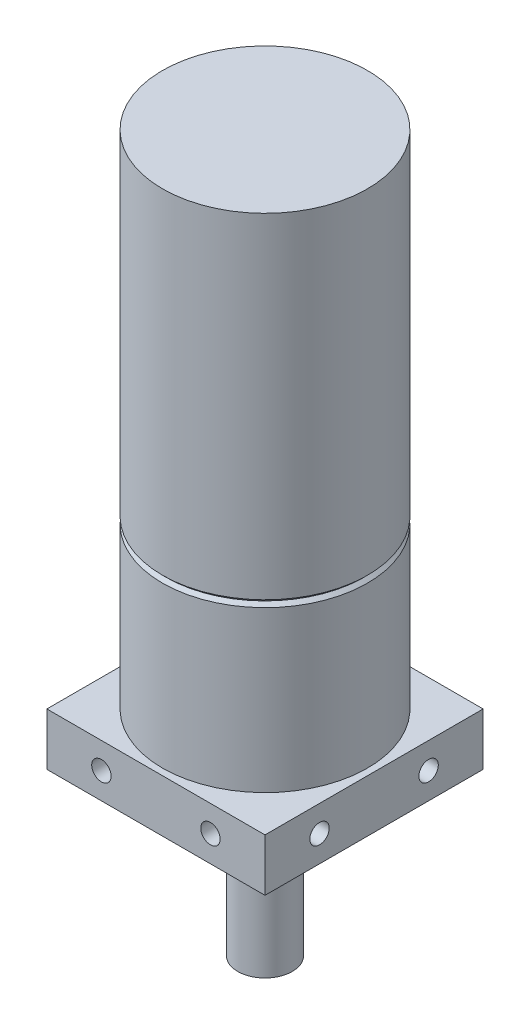
ISO-10303-21;
HEADER;
FILE_DESCRIPTION(('STEP AP214'),'2;1');
FILE_NAME('part.step','',(''),(''),'','','');
FILE_SCHEMA(('AUTOMOTIVE_DESIGN { 1 0 10303 214 1 1 1 1 }'));
ENDSEC;
DATA;
#1=APPLICATION_CONTEXT('core data for automotive mechanical design processes');
#2=APPLICATION_PROTOCOL_DEFINITION('international standard','automotive_design',2000,#1);
#3=PRODUCT_CONTEXT('',#1,'mechanical');
#4=PRODUCT('Part','Part','',(#3));
#5=PRODUCT_RELATED_PRODUCT_CATEGORY('part','',(#4));
#6=PRODUCT_DEFINITION_FORMATION('','',#4);
#7=PRODUCT_DEFINITION_CONTEXT('part definition',#1,'design');
#8=PRODUCT_DEFINITION('design','',#6,#7);
#9=PRODUCT_DEFINITION_SHAPE('','',#8);
#10=(LENGTH_UNIT() NAMED_UNIT(*) SI_UNIT(.MILLI.,.METRE.));
#11=(NAMED_UNIT(*) PLANE_ANGLE_UNIT() SI_UNIT($,.RADIAN.));
#12=(NAMED_UNIT(*) SI_UNIT($,.STERADIAN.) SOLID_ANGLE_UNIT());
#13=UNCERTAINTY_MEASURE_WITH_UNIT(LENGTH_MEASURE(1.E-05),#10,'distance_accuracy_value','');
#14=(GEOMETRIC_REPRESENTATION_CONTEXT(3) GLOBAL_UNCERTAINTY_ASSIGNED_CONTEXT((#13)) GLOBAL_UNIT_ASSIGNED_CONTEXT((#10,
#11,#12)) REPRESENTATION_CONTEXT('',''));
#15=CARTESIAN_POINT('',(0.,0.,0.));
#16=DIRECTION('',(0.,0.,1.));
#17=DIRECTION('',(1.,0.,0.));
#18=AXIS2_PLACEMENT_3D('',#15,#16,#17);
#19=CARTESIAN_POINT('',(-12.7,0.,12.7));
#20=DIRECTION('',(0.,1.,0.));
#21=DIRECTION('',(0.,0.,1.));
#22=AXIS2_PLACEMENT_3D('',#19,#20,#21);
#23=PLANE('',#22);
#24=CARTESIAN_POINT('',(6.35,0.,-6.35));
#25=DIRECTION('',(0.,-1.,0.));
#26=DIRECTION('',(0.,0.,-1.));
#27=AXIS2_PLACEMENT_3D('',#24,#25,#26);
#28=CIRCLE('',#27,1.13029999999999);
#29=CARTESIAN_POINT('',(6.35,0.,-7.48029999999999));
#30=VERTEX_POINT('',#29);
#31=EDGE_CURVE('E186',#30,#30,#28,.T.);
#32=ORIENTED_EDGE('',*,*,#31,.F.);
#33=EDGE_LOOP('',(#32));
#34=FACE_BOUND('',#33,.T.);
#35=CARTESIAN_POINT('',(6.35,0.,6.35));
#36=DIRECTION('',(0.,-1.,0.));
#37=DIRECTION('',(0.,0.,-1.));
#38=AXIS2_PLACEMENT_3D('',#35,#36,#37);
#39=CIRCLE('',#38,1.13029999999999);
#40=CARTESIAN_POINT('',(6.35,0.,5.21970000000001));
#41=VERTEX_POINT('',#40);
#42=EDGE_CURVE('E192',#41,#41,#39,.T.);
#43=ORIENTED_EDGE('',*,*,#42,.F.);
#44=EDGE_LOOP('',(#43));
#45=FACE_BOUND('',#44,.T.);
#46=CARTESIAN_POINT('',(-6.35,0.,6.35));
#47=DIRECTION('',(0.,-1.,0.));
#48=DIRECTION('',(0.,0.,-1.));
#49=AXIS2_PLACEMENT_3D('',#46,#47,#48);
#50=CIRCLE('',#49,1.13029999999999);
#51=CARTESIAN_POINT('',(-6.35,0.,5.21970000000001));
#52=VERTEX_POINT('',#51);
#53=EDGE_CURVE('E198',#52,#52,#50,.T.);
#54=ORIENTED_EDGE('',*,*,#53,.F.);
#55=EDGE_LOOP('',(#54));
#56=FACE_BOUND('',#55,.T.);
#57=CARTESIAN_POINT('',(-6.35,0.,-6.35));
#58=DIRECTION('',(0.,-1.,0.));
#59=DIRECTION('',(0.,0.,-1.));
#60=AXIS2_PLACEMENT_3D('',#57,#58,#59);
#61=CIRCLE('',#60,1.13029999999999);
#62=CARTESIAN_POINT('',(-6.35,0.,-7.48029999999999));
#63=VERTEX_POINT('',#62);
#64=EDGE_CURVE('E204',#63,#63,#61,.T.);
#65=ORIENTED_EDGE('',*,*,#64,.F.);
#66=EDGE_LOOP('',(#65));
#67=FACE_BOUND('',#66,.T.);
#68=DIRECTION('',(0.,0.,1.));
#69=VECTOR('',#68,1.);
#70=CARTESIAN_POINT('',(-12.7,0.,-12.7));
#71=LINE('',#70,#69);
#72=CARTESIAN_POINT('',(-12.7,0.,-12.7));
#73=VERTEX_POINT('',#72);
#74=CARTESIAN_POINT('',(-12.7,0.,12.7));
#75=VERTEX_POINT('',#74);
#76=EDGE_CURVE('E217',#73,#75,#71,.T.);
#77=ORIENTED_EDGE('',*,*,#76,.F.);
#78=DIRECTION('',(-1.,0.,0.));
#79=VECTOR('',#78,1.);
#80=CARTESIAN_POINT('',(-12.7,0.,-12.7));
#81=LINE('',#80,#79);
#82=CARTESIAN_POINT('',(12.7,0.,-12.7));
#83=VERTEX_POINT('',#82);
#84=EDGE_CURVE('E79',#83,#73,#81,.T.);
#85=ORIENTED_EDGE('',*,*,#84,.F.);
#86=DIRECTION('',(0.,0.,-1.));
#87=VECTOR('',#86,1.);
#88=CARTESIAN_POINT('',(12.7,0.,-12.7));
#89=LINE('',#88,#87);
#90=CARTESIAN_POINT('',(12.7,0.,12.7));
#91=VERTEX_POINT('',#90);
#92=EDGE_CURVE('E73',#91,#83,#89,.T.);
#93=ORIENTED_EDGE('',*,*,#92,.F.);
#94=DIRECTION('',(1.,0.,0.));
#95=VECTOR('',#94,1.);
#96=CARTESIAN_POINT('',(-12.7,0.,12.7));
#97=LINE('',#96,#95);
#98=EDGE_CURVE('E229',#75,#91,#97,.T.);
#99=ORIENTED_EDGE('',*,*,#98,.F.);
#100=EDGE_LOOP('',(#77,#85,#93,#99));
#101=FACE_BOUND('',#100,.T.);
#102=CARTESIAN_POINT('',(0.,0.,0.));
#103=DIRECTION('',(0.,1.,0.));
#104=DIRECTION('',(0.,0.,1.));
#105=AXIS2_PLACEMENT_3D('',#102,#103,#104);
#106=CIRCLE('',#105,3.175);
#107=CARTESIAN_POINT('',(0.,0.,3.175));
#108=VERTEX_POINT('',#107);
#109=EDGE_CURVE('E11',#108,#108,#106,.F.);
#110=ORIENTED_EDGE('',*,*,#109,.F.);
#111=EDGE_LOOP('',(#110));
#112=FACE_BOUND('',#111,.T.);
#113=ADVANCED_FACE('F38',(#34,#45,#56,#67,#101,#112),#23,.F.);
#114=CARTESIAN_POINT('',(-12.7,6.096,12.7));
#115=DIRECTION('',(0.,1.,0.));
#116=DIRECTION('',(0.,0.,1.));
#117=AXIS2_PLACEMENT_3D('',#114,#115,#116);
#118=PLANE('',#117);
#119=DIRECTION('',(0.,0.,1.));
#120=VECTOR('',#119,1.);
#121=CARTESIAN_POINT('',(-12.7,6.096,-12.7));
#122=LINE('',#121,#120);
#123=CARTESIAN_POINT('',(-12.7,6.096,-12.7));
#124=VERTEX_POINT('',#123);
#125=CARTESIAN_POINT('',(-12.7,6.096,12.7));
#126=VERTEX_POINT('',#125);
#127=EDGE_CURVE('E220',#124,#126,#122,.T.);
#128=ORIENTED_EDGE('',*,*,#127,.T.);
#129=DIRECTION('',(1.,0.,0.));
#130=VECTOR('',#129,1.);
#131=CARTESIAN_POINT('',(-12.7,6.096,12.7));
#132=LINE('',#131,#130);
#133=CARTESIAN_POINT('',(12.7,6.096,12.7));
#134=VERTEX_POINT('',#133);
#135=EDGE_CURVE('E87',#126,#134,#132,.T.);
#136=ORIENTED_EDGE('',*,*,#135,.T.);
#137=DIRECTION('',(0.,0.,-1.));
#138=VECTOR('',#137,1.);
#139=CARTESIAN_POINT('',(12.7,6.096,-12.7));
#140=LINE('',#139,#138);
#141=CARTESIAN_POINT('',(12.7,6.096,-12.7));
#142=VERTEX_POINT('',#141);
#143=EDGE_CURVE('E223',#134,#142,#140,.T.);
#144=ORIENTED_EDGE('',*,*,#143,.T.);
#145=DIRECTION('',(-1.,0.,0.));
#146=VECTOR('',#145,1.);
#147=CARTESIAN_POINT('',(-12.7,6.096,-12.7));
#148=LINE('',#147,#146);
#149=EDGE_CURVE('E55',#142,#124,#148,.T.);
#150=ORIENTED_EDGE('',*,*,#149,.T.);
#151=EDGE_LOOP('',(#128,#136,#144,#150));
#152=FACE_BOUND('',#151,.T.);
#153=CARTESIAN_POINT('',(0.,6.096,0.));
#154=DIRECTION('',(0.,1.,0.));
#155=DIRECTION('',(0.,0.,1.));
#156=AXIS2_PLACEMENT_3D('',#153,#154,#155);
#157=CIRCLE('',#156,11.938);
#158=CARTESIAN_POINT('',(0.,6.096,11.938));
#159=VERTEX_POINT('',#158);
#160=EDGE_CURVE('E213',#159,#159,#157,.T.);
#161=ORIENTED_EDGE('',*,*,#160,.F.);
#162=EDGE_LOOP('',(#161));
#163=FACE_BOUND('',#162,.T.);
#164=ADVANCED_FACE('F245',(#152,#163),#118,.T.);
#165=CARTESIAN_POINT('',(-12.7,6.096,-12.7));
#166=DIRECTION('',(1.,0.,0.));
#167=DIRECTION('',(0.,0.,-1.));
#168=AXIS2_PLACEMENT_3D('',#165,#166,#167);
#169=PLANE('',#168);
#170=CARTESIAN_POINT('',(-12.7,3.048,-6.35));
#171=DIRECTION('',(-1.,0.,0.));
#172=DIRECTION('',(0.,0.,1.));
#173=AXIS2_PLACEMENT_3D('',#170,#171,#172);
#174=CIRCLE('',#173,1.13029999999999);
#175=CARTESIAN_POINT('',(-12.7,3.048,-5.21970000000001));
#176=VERTEX_POINT('',#175);
#177=EDGE_CURVE('E177',#176,#176,#174,.T.);
#178=ORIENTED_EDGE('',*,*,#177,.F.);
#179=EDGE_LOOP('',(#178));
#180=FACE_BOUND('',#179,.T.);
#181=CARTESIAN_POINT('',(-12.7,3.048,6.35));
#182=DIRECTION('',(-1.,0.,0.));
#183=DIRECTION('',(0.,0.,1.));
#184=AXIS2_PLACEMENT_3D('',#181,#182,#183);
#185=CIRCLE('',#184,1.13029999999999);
#186=CARTESIAN_POINT('',(-12.7,3.048,7.48029999999999));
#187=VERTEX_POINT('',#186);
#188=EDGE_CURVE('E183',#187,#187,#185,.T.);
#189=ORIENTED_EDGE('',*,*,#188,.F.);
#190=EDGE_LOOP('',(#189));
#191=FACE_BOUND('',#190,.T.);
#192=ORIENTED_EDGE('',*,*,#76,.T.);
#193=DIRECTION('',(0.,-1.,0.));
#194=VECTOR('',#193,1.);
#195=CARTESIAN_POINT('',(-12.7,6.096,12.7));
#196=LINE('',#195,#194);
#197=EDGE_CURVE('E47',#126,#75,#196,.T.);
#198=ORIENTED_EDGE('',*,*,#197,.F.);
#199=ORIENTED_EDGE('',*,*,#127,.F.);
#200=DIRECTION('',(0.,-1.,0.));
#201=VECTOR('',#200,1.);
#202=CARTESIAN_POINT('',(-12.7,6.096,-12.7));
#203=LINE('',#202,#201);
#204=EDGE_CURVE('E226',#124,#73,#203,.T.);
#205=ORIENTED_EDGE('',*,*,#204,.T.);
#206=EDGE_LOOP('',(#192,#198,#199,#205));
#207=FACE_BOUND('',#206,.T.);
#208=ADVANCED_FACE('F40',(#180,#191,#207),#169,.F.);
#209=CARTESIAN_POINT('',(-12.7,6.096,12.7));
#210=DIRECTION('',(0.,0.,-1.));
#211=DIRECTION('',(-1.,0.,0.));
#212=AXIS2_PLACEMENT_3D('',#209,#210,#211);
#213=PLANE('',#212);
#214=CARTESIAN_POINT('',(-6.34999999999996,3.048,12.7));
#215=DIRECTION('',(0.,0.,1.));
#216=DIRECTION('',(1.,0.,0.));
#217=AXIS2_PLACEMENT_3D('',#214,#215,#216);
#218=CIRCLE('',#217,1.13029999999999);
#219=CARTESIAN_POINT('',(-5.21969999999997,3.048,12.7));
#220=VERTEX_POINT('',#219);
#221=EDGE_CURVE('E165',#220,#220,#218,.T.);
#222=ORIENTED_EDGE('',*,*,#221,.F.);
#223=EDGE_LOOP('',(#222));
#224=FACE_BOUND('',#223,.T.);
#225=CARTESIAN_POINT('',(6.35000000000004,3.048,12.7));
#226=DIRECTION('',(0.,0.,1.));
#227=DIRECTION('',(1.,0.,0.));
#228=AXIS2_PLACEMENT_3D('',#225,#226,#227);
#229=CIRCLE('',#228,1.13029999999999);
#230=CARTESIAN_POINT('',(7.48030000000003,3.048,12.7));
#231=VERTEX_POINT('',#230);
#232=EDGE_CURVE('E171',#231,#231,#229,.T.);
#233=ORIENTED_EDGE('',*,*,#232,.F.);
#234=EDGE_LOOP('',(#233));
#235=FACE_BOUND('',#234,.T.);
#236=ORIENTED_EDGE('',*,*,#98,.T.);
#237=DIRECTION('',(0.,-1.,0.));
#238=VECTOR('',#237,1.);
#239=CARTESIAN_POINT('',(12.7,6.096,12.7));
#240=LINE('',#239,#238);
#241=EDGE_CURVE('E236',#134,#91,#240,.T.);
#242=ORIENTED_EDGE('',*,*,#241,.F.);
#243=ORIENTED_EDGE('',*,*,#135,.F.);
#244=ORIENTED_EDGE('',*,*,#197,.T.);
#245=EDGE_LOOP('',(#236,#242,#243,#244));
#246=FACE_BOUND('',#245,.T.);
#247=ADVANCED_FACE('F238',(#224,#235,#246),#213,.F.);
#248=CARTESIAN_POINT('',(12.7,6.096,-12.7));
#249=DIRECTION('',(-1.,0.,0.));
#250=DIRECTION('',(0.,0.,1.));
#251=AXIS2_PLACEMENT_3D('',#248,#249,#250);
#252=PLANE('',#251);
#253=CARTESIAN_POINT('',(12.7,3.048,6.34999999999991));
#254=DIRECTION('',(1.,0.,0.));
#255=DIRECTION('',(0.,0.,-1.));
#256=AXIS2_PLACEMENT_3D('',#253,#254,#255);
#257=CIRCLE('',#256,1.13029999999999);
#258=CARTESIAN_POINT('',(12.7,3.048,5.21969999999992));
#259=VERTEX_POINT('',#258);
#260=EDGE_CURVE('E153',#259,#259,#257,.T.);
#261=ORIENTED_EDGE('',*,*,#260,.F.);
#262=EDGE_LOOP('',(#261));
#263=FACE_BOUND('',#262,.T.);
#264=CARTESIAN_POINT('',(12.7,3.048,-6.35000000000009));
#265=DIRECTION('',(1.,0.,0.));
#266=DIRECTION('',(0.,0.,-1.));
#267=AXIS2_PLACEMENT_3D('',#264,#265,#266);
#268=CIRCLE('',#267,1.13029999999999);
#269=CARTESIAN_POINT('',(12.6999999999999,3.048,-7.48030000000008));
#270=VERTEX_POINT('',#269);
#271=EDGE_CURVE('E159',#270,#270,#268,.T.);
#272=ORIENTED_EDGE('',*,*,#271,.F.);
#273=EDGE_LOOP('',(#272));
#274=FACE_BOUND('',#273,.T.);
#275=ORIENTED_EDGE('',*,*,#92,.T.);
#276=DIRECTION('',(0.,-1.,0.));
#277=VECTOR('',#276,1.);
#278=CARTESIAN_POINT('',(12.7,6.096,-12.7));
#279=LINE('',#278,#277);
#280=EDGE_CURVE('E234',#142,#83,#279,.T.);
#281=ORIENTED_EDGE('',*,*,#280,.F.);
#282=ORIENTED_EDGE('',*,*,#143,.F.);
#283=ORIENTED_EDGE('',*,*,#241,.T.);
#284=EDGE_LOOP('',(#275,#281,#282,#283));
#285=FACE_BOUND('',#284,.T.);
#286=ADVANCED_FACE('F279',(#263,#274,#285),#252,.F.);
#287=CARTESIAN_POINT('',(-12.7,6.096,-12.7));
#288=DIRECTION('',(0.,0.,1.));
#289=DIRECTION('',(1.,0.,0.));
#290=AXIS2_PLACEMENT_3D('',#287,#288,#289);
#291=PLANE('',#290);
#292=CARTESIAN_POINT('',(6.34999999999987,3.048,-12.7000000000001));
#293=DIRECTION('',(0.,0.,-1.));
#294=DIRECTION('',(-1.,0.,0.));
#295=AXIS2_PLACEMENT_3D('',#292,#293,#294);
#296=CIRCLE('',#295,1.13029999999999);
#297=CARTESIAN_POINT('',(5.21969999999988,3.048,-12.7000000000001));
#298=VERTEX_POINT('',#297);
#299=EDGE_CURVE('E134',#298,#298,#296,.T.);
#300=ORIENTED_EDGE('',*,*,#299,.F.);
#301=EDGE_LOOP('',(#300));
#302=FACE_BOUND('',#301,.T.);
#303=CARTESIAN_POINT('',(-6.35000000000013,3.048,-12.6999999999999));
#304=DIRECTION('',(0.,0.,-1.));
#305=DIRECTION('',(-1.,0.,0.));
#306=AXIS2_PLACEMENT_3D('',#303,#304,#305);
#307=CIRCLE('',#306,1.13029999999999);
#308=CARTESIAN_POINT('',(-7.48030000000012,3.048,-12.6999999999999));
#309=VERTEX_POINT('',#308);
#310=EDGE_CURVE('E147',#309,#309,#307,.T.);
#311=ORIENTED_EDGE('',*,*,#310,.F.);
#312=EDGE_LOOP('',(#311));
#313=FACE_BOUND('',#312,.T.);
#314=ORIENTED_EDGE('',*,*,#84,.T.);
#315=ORIENTED_EDGE('',*,*,#204,.F.);
#316=ORIENTED_EDGE('',*,*,#149,.F.);
#317=ORIENTED_EDGE('',*,*,#280,.T.);
#318=EDGE_LOOP('',(#314,#315,#316,#317));
#319=FACE_BOUND('',#318,.T.);
#320=ADVANCED_FACE('F263',(#302,#313,#319),#291,.F.);
#321=CARTESIAN_POINT('',(0.,64.516,0.));
#322=DIRECTION('',(0.,-1.,0.));
#323=DIRECTION('',(0.,0.,-1.));
#324=AXIS2_PLACEMENT_3D('',#321,#322,#323);
#325=CYLINDRICAL_SURFACE('',#324,11.938);
#326=CARTESIAN_POINT('',(0.,24.749125,0.));
#327=DIRECTION('',(0.,1.,0.));
#328=DIRECTION('',(0.,0.,1.));
#329=AXIS2_PLACEMENT_3D('',#326,#327,#328);
#330=CIRCLE('',#329,11.938);
#331=CARTESIAN_POINT('',(0.,24.749125,11.938));
#332=VERTEX_POINT('',#331);
#333=EDGE_CURVE('E627',#332,#332,#330,.T.);
#334=ORIENTED_EDGE('',*,*,#333,.F.);
#335=EDGE_LOOP('',(#334));
#336=FACE_BOUND('',#335,.T.);
#337=ORIENTED_EDGE('',*,*,#160,.T.);
#338=EDGE_LOOP('',(#337));
#339=FACE_BOUND('',#338,.T.);
#340=ADVANCED_FACE('F253',(#336,#339),#325,.T.);
#341=CARTESIAN_POINT('',(0.,-18.796,0.));
#342=DIRECTION('',(0.,1.,0.));
#343=DIRECTION('',(0.,0.,1.));
#344=AXIS2_PLACEMENT_3D('',#341,#342,#343);
#345=CYLINDRICAL_SURFACE('',#344,3.175);
#346=CARTESIAN_POINT('',(0.,-18.796,0.));
#347=DIRECTION('',(0.,-1.,0.));
#348=DIRECTION('',(0.,0.,-1.));
#349=AXIS2_PLACEMENT_3D('',#346,#347,#348);
#350=CIRCLE('',#349,3.175);
#351=CARTESIAN_POINT('',(0.,-18.796,-3.175));
#352=VERTEX_POINT('',#351);
#353=EDGE_CURVE('E210',#352,#352,#350,.T.);
#354=ORIENTED_EDGE('',*,*,#353,.F.);
#355=EDGE_LOOP('',(#354));
#356=FACE_BOUND('',#355,.T.);
#357=ORIENTED_EDGE('',*,*,#109,.T.);
#358=EDGE_LOOP('',(#357));
#359=FACE_BOUND('',#358,.T.);
#360=ADVANCED_FACE('F250',(#356,#359),#345,.T.);
#361=CARTESIAN_POINT('',(0.,-18.796,0.));
#362=DIRECTION('',(0.,-1.,0.));
#363=DIRECTION('',(0.,0.,-1.));
#364=AXIS2_PLACEMENT_3D('',#361,#362,#363);
#365=PLANE('',#364);
#366=ORIENTED_EDGE('',*,*,#353,.T.);
#367=EDGE_LOOP('',(#366));
#368=FACE_BOUND('',#367,.T.);
#369=ADVANCED_FACE('F252',(#368),#365,.T.);
#370=CARTESIAN_POINT('',(-6.35,3.048,-6.35));
#371=DIRECTION('',(0.,-1.,0.));
#372=DIRECTION('',(0.,0.,-1.));
#373=AXIS2_PLACEMENT_3D('',#370,#371,#372);
#374=CONICAL_SURFACE('',#373,1.1303,1.02974425867665);
#375=CARTESIAN_POINT('',(-6.35,3.72715275768685,-6.35));
#376=VERTEX_POINT('',#375);
#377=VERTEX_LOOP('',#376);
#378=FACE_BOUND('',#377,.T.);
#379=CARTESIAN_POINT('',(-6.35,3.048,-6.35));
#380=DIRECTION('',(0.,-1.,0.));
#381=DIRECTION('',(0.,0.,-1.));
#382=AXIS2_PLACEMENT_3D('',#379,#380,#381);
#383=CIRCLE('',#382,1.1303);
#384=CARTESIAN_POINT('',(-6.35,3.048,-7.4803));
#385=VERTEX_POINT('',#384);
#386=EDGE_CURVE('E207',#385,#385,#383,.T.);
#387=ORIENTED_EDGE('',*,*,#386,.T.);
#388=EDGE_LOOP('',(#387));
#389=FACE_BOUND('',#388,.T.);
#390=ADVANCED_FACE('F260',(#378,#389),#374,.F.);
#391=CARTESIAN_POINT('',(-6.35,0.,-6.35));
#392=DIRECTION('',(0.,-1.,0.));
#393=DIRECTION('',(0.,0.,-1.));
#394=AXIS2_PLACEMENT_3D('',#391,#392,#393);
#395=CYLINDRICAL_SURFACE('',#394,1.13029999999999);
#396=ORIENTED_EDGE('',*,*,#386,.F.);
#397=EDGE_LOOP('',(#396));
#398=FACE_BOUND('',#397,.T.);
#399=ORIENTED_EDGE('',*,*,#64,.T.);
#400=EDGE_LOOP('',(#399));
#401=FACE_BOUND('',#400,.T.);
#402=ADVANCED_FACE('F346',(#398,#401),#395,.F.);
#403=CARTESIAN_POINT('',(-6.35,3.048,6.35));
#404=DIRECTION('',(0.,-1.,0.));
#405=DIRECTION('',(0.,0.,-1.));
#406=AXIS2_PLACEMENT_3D('',#403,#404,#405);
#407=CONICAL_SURFACE('',#406,1.1303,1.02974425867665);
#408=CARTESIAN_POINT('',(-6.35000000000001,3.72715275768685,6.35));
#409=VERTEX_POINT('',#408);
#410=VERTEX_LOOP('',#409);
#411=FACE_BOUND('',#410,.T.);
#412=CARTESIAN_POINT('',(-6.35,3.048,6.35));
#413=DIRECTION('',(0.,-1.,0.));
#414=DIRECTION('',(0.,0.,-1.));
#415=AXIS2_PLACEMENT_3D('',#412,#413,#414);
#416=CIRCLE('',#415,1.1303);
#417=CARTESIAN_POINT('',(-6.35,3.048,5.2197));
#418=VERTEX_POINT('',#417);
#419=EDGE_CURVE('E201',#418,#418,#416,.T.);
#420=ORIENTED_EDGE('',*,*,#419,.T.);
#421=EDGE_LOOP('',(#420));
#422=FACE_BOUND('',#421,.T.);
#423=ADVANCED_FACE('F342',(#411,#422),#407,.F.);
#424=CARTESIAN_POINT('',(-6.35,0.,6.35));
#425=DIRECTION('',(0.,-1.,0.));
#426=DIRECTION('',(0.,0.,-1.));
#427=AXIS2_PLACEMENT_3D('',#424,#425,#426);
#428=CYLINDRICAL_SURFACE('',#427,1.13029999999999);
#429=ORIENTED_EDGE('',*,*,#419,.F.);
#430=EDGE_LOOP('',(#429));
#431=FACE_BOUND('',#430,.T.);
#432=ORIENTED_EDGE('',*,*,#53,.T.);
#433=EDGE_LOOP('',(#432));
#434=FACE_BOUND('',#433,.T.);
#435=ADVANCED_FACE('F338',(#431,#434),#428,.F.);
#436=CARTESIAN_POINT('',(6.35,3.048,6.35));
#437=DIRECTION('',(0.,-1.,0.));
#438=DIRECTION('',(0.,0.,-1.));
#439=AXIS2_PLACEMENT_3D('',#436,#437,#438);
#440=CONICAL_SURFACE('',#439,1.1303,1.02974425867665);
#441=CARTESIAN_POINT('',(6.35,3.72715275768685,6.35));
#442=VERTEX_POINT('',#441);
#443=VERTEX_LOOP('',#442);
#444=FACE_BOUND('',#443,.T.);
#445=CARTESIAN_POINT('',(6.35,3.048,6.35));
#446=DIRECTION('',(0.,-1.,0.));
#447=DIRECTION('',(0.,0.,-1.));
#448=AXIS2_PLACEMENT_3D('',#445,#446,#447);
#449=CIRCLE('',#448,1.1303);
#450=CARTESIAN_POINT('',(6.35,3.048,5.2197));
#451=VERTEX_POINT('',#450);
#452=EDGE_CURVE('E195',#451,#451,#449,.T.);
#453=ORIENTED_EDGE('',*,*,#452,.T.);
#454=EDGE_LOOP('',(#453));
#455=FACE_BOUND('',#454,.T.);
#456=ADVANCED_FACE('F334',(#444,#455),#440,.F.);
#457=CARTESIAN_POINT('',(6.35,0.,6.35));
#458=DIRECTION('',(0.,-1.,0.));
#459=DIRECTION('',(0.,0.,-1.));
#460=AXIS2_PLACEMENT_3D('',#457,#458,#459);
#461=CYLINDRICAL_SURFACE('',#460,1.13029999999999);
#462=ORIENTED_EDGE('',*,*,#452,.F.);
#463=EDGE_LOOP('',(#462));
#464=FACE_BOUND('',#463,.T.);
#465=ORIENTED_EDGE('',*,*,#42,.T.);
#466=EDGE_LOOP('',(#465));
#467=FACE_BOUND('',#466,.T.);
#468=ADVANCED_FACE('F330',(#464,#467),#461,.F.);
#469=CARTESIAN_POINT('',(6.35,3.048,-6.35));
#470=DIRECTION('',(0.,-1.,0.));
#471=DIRECTION('',(0.,0.,-1.));
#472=AXIS2_PLACEMENT_3D('',#469,#470,#471);
#473=CONICAL_SURFACE('',#472,1.1303,1.02974425867665);
#474=CARTESIAN_POINT('',(6.35,3.72715275768685,-6.35));
#475=VERTEX_POINT('',#474);
#476=VERTEX_LOOP('',#475);
#477=FACE_BOUND('',#476,.T.);
#478=CARTESIAN_POINT('',(6.35,3.048,-6.35));
#479=DIRECTION('',(0.,-1.,0.));
#480=DIRECTION('',(0.,0.,-1.));
#481=AXIS2_PLACEMENT_3D('',#478,#479,#480);
#482=CIRCLE('',#481,1.1303);
#483=CARTESIAN_POINT('',(6.35,3.048,-7.4803));
#484=VERTEX_POINT('',#483);
#485=EDGE_CURVE('E189',#484,#484,#482,.T.);
#486=ORIENTED_EDGE('',*,*,#485,.T.);
#487=EDGE_LOOP('',(#486));
#488=FACE_BOUND('',#487,.T.);
#489=ADVANCED_FACE('F326',(#477,#488),#473,.F.);
#490=CARTESIAN_POINT('',(6.35,0.,-6.35));
#491=DIRECTION('',(0.,-1.,0.));
#492=DIRECTION('',(0.,0.,-1.));
#493=AXIS2_PLACEMENT_3D('',#490,#491,#492);
#494=CYLINDRICAL_SURFACE('',#493,1.13029999999999);
#495=ORIENTED_EDGE('',*,*,#485,.F.);
#496=EDGE_LOOP('',(#495));
#497=FACE_BOUND('',#496,.T.);
#498=ORIENTED_EDGE('',*,*,#31,.T.);
#499=EDGE_LOOP('',(#498));
#500=FACE_BOUND('',#499,.T.);
#501=ADVANCED_FACE('F322',(#497,#500),#494,.F.);
#502=CARTESIAN_POINT('',(-12.7,3.048,6.35));
#503=DIRECTION('',(-1.,0.,0.));
#504=DIRECTION('',(0.,0.,1.));
#505=AXIS2_PLACEMENT_3D('',#502,#503,#504);
#506=CYLINDRICAL_SURFACE('',#505,1.13029999999999);
#507=CARTESIAN_POINT('',(-8.509,3.048,6.35));
#508=DIRECTION('',(-1.,0.,0.));
#509=DIRECTION('',(0.,0.,1.));
#510=AXIS2_PLACEMENT_3D('',#507,#508,#509);
#511=CIRCLE('',#510,1.1303);
#512=CARTESIAN_POINT('',(-8.509,3.048,7.4803));
#513=VERTEX_POINT('',#512);
#514=EDGE_CURVE('E180',#513,#513,#511,.T.);
#515=ORIENTED_EDGE('',*,*,#514,.F.);
#516=EDGE_LOOP('',(#515));
#517=FACE_BOUND('',#516,.T.);
#518=ORIENTED_EDGE('',*,*,#188,.T.);
#519=EDGE_LOOP('',(#518));
#520=FACE_BOUND('',#519,.T.);
#521=ADVANCED_FACE('F318',(#517,#520),#506,.F.);
#522=CARTESIAN_POINT('',(-8.509,3.048,6.35));
#523=DIRECTION('',(-1.,0.,0.));
#524=DIRECTION('',(0.,0.,1.));
#525=AXIS2_PLACEMENT_3D('',#522,#523,#524);
#526=CONICAL_SURFACE('',#525,1.1303,1.02974425867665);
#527=CARTESIAN_POINT('',(-7.82984724231315,3.048,6.35));
#528=VERTEX_POINT('',#527);
#529=VERTEX_LOOP('',#528);
#530=FACE_BOUND('',#529,.T.);
#531=ORIENTED_EDGE('',*,*,#514,.T.);
#532=EDGE_LOOP('',(#531));
#533=FACE_BOUND('',#532,.T.);
#534=ADVANCED_FACE('F314',(#530,#533),#526,.F.);
#535=CARTESIAN_POINT('',(-12.7,3.048,-6.35));
#536=DIRECTION('',(-1.,0.,0.));
#537=DIRECTION('',(0.,0.,1.));
#538=AXIS2_PLACEMENT_3D('',#535,#536,#537);
#539=CYLINDRICAL_SURFACE('',#538,1.13029999999999);
#540=CARTESIAN_POINT('',(-8.509,3.048,-6.35));
#541=DIRECTION('',(-1.,0.,0.));
#542=DIRECTION('',(0.,0.,1.));
#543=AXIS2_PLACEMENT_3D('',#540,#541,#542);
#544=CIRCLE('',#543,1.1303);
#545=CARTESIAN_POINT('',(-8.509,3.048,-5.2197));
#546=VERTEX_POINT('',#545);
#547=EDGE_CURVE('E174',#546,#546,#544,.T.);
#548=ORIENTED_EDGE('',*,*,#547,.F.);
#549=EDGE_LOOP('',(#548));
#550=FACE_BOUND('',#549,.T.);
#551=ORIENTED_EDGE('',*,*,#177,.T.);
#552=EDGE_LOOP('',(#551));
#553=FACE_BOUND('',#552,.T.);
#554=ADVANCED_FACE('F306',(#550,#553),#539,.F.);
#555=CARTESIAN_POINT('',(-8.509,3.048,-6.35));
#556=DIRECTION('',(-1.,0.,0.));
#557=DIRECTION('',(0.,0.,1.));
#558=AXIS2_PLACEMENT_3D('',#555,#556,#557);
#559=CONICAL_SURFACE('',#558,1.1303,1.02974425867665);
#560=CARTESIAN_POINT('',(-7.82984724231315,3.048,-6.35));
#561=VERTEX_POINT('',#560);
#562=VERTEX_LOOP('',#561);
#563=FACE_BOUND('',#562,.T.);
#564=ORIENTED_EDGE('',*,*,#547,.T.);
#565=EDGE_LOOP('',(#564));
#566=FACE_BOUND('',#565,.T.);
#567=ADVANCED_FACE('F296',(#563,#566),#559,.F.);
#568=CARTESIAN_POINT('',(6.35000000000004,3.048,12.7));
#569=DIRECTION('',(0.,0.,1.));
#570=DIRECTION('',(1.,0.,0.));
#571=AXIS2_PLACEMENT_3D('',#568,#569,#570);
#572=CYLINDRICAL_SURFACE('',#571,1.13029999999999);
#573=CARTESIAN_POINT('',(6.35000000000004,3.048,8.50899999999998));
#574=DIRECTION('',(0.,0.,1.));
#575=DIRECTION('',(1.,0.,0.));
#576=AXIS2_PLACEMENT_3D('',#573,#574,#575);
#577=CIRCLE('',#576,1.1303);
#578=CARTESIAN_POINT('',(7.48030000000004,3.048,8.50899999999998));
#579=VERTEX_POINT('',#578);
#580=EDGE_CURVE('E168',#579,#579,#577,.T.);
#581=ORIENTED_EDGE('',*,*,#580,.F.);
#582=EDGE_LOOP('',(#581));
#583=FACE_BOUND('',#582,.T.);
#584=ORIENTED_EDGE('',*,*,#232,.T.);
#585=EDGE_LOOP('',(#584));
#586=FACE_BOUND('',#585,.T.);
#587=ADVANCED_FACE('F293',(#583,#586),#572,.F.);
#588=CARTESIAN_POINT('',(6.35000000000004,3.048,8.50899999999998));
#589=DIRECTION('',(0.,0.,1.));
#590=DIRECTION('',(1.,0.,0.));
#591=AXIS2_PLACEMENT_3D('',#588,#589,#590);
#592=CONICAL_SURFACE('',#591,1.1303,1.02974425867665);
#593=CARTESIAN_POINT('',(6.35000000000004,3.048,7.82984724231312));
#594=VERTEX_POINT('',#593);
#595=VERTEX_LOOP('',#594);
#596=FACE_BOUND('',#595,.T.);
#597=ORIENTED_EDGE('',*,*,#580,.T.);
#598=EDGE_LOOP('',(#597));
#599=FACE_BOUND('',#598,.T.);
#600=ADVANCED_FACE('F295',(#596,#599),#592,.F.);
#601=CARTESIAN_POINT('',(-6.34999999999996,3.048,12.7));
#602=DIRECTION('',(0.,0.,1.));
#603=DIRECTION('',(1.,0.,0.));
#604=AXIS2_PLACEMENT_3D('',#601,#602,#603);
#605=CYLINDRICAL_SURFACE('',#604,1.13029999999999);
#606=CARTESIAN_POINT('',(-6.34999999999996,3.048,8.50900000000002));
#607=DIRECTION('',(0.,0.,1.));
#608=DIRECTION('',(1.,0.,0.));
#609=AXIS2_PLACEMENT_3D('',#606,#607,#608);
#610=CIRCLE('',#609,1.1303);
#611=CARTESIAN_POINT('',(-5.21969999999996,3.048,8.50900000000002));
#612=VERTEX_POINT('',#611);
#613=EDGE_CURVE('E162',#612,#612,#610,.T.);
#614=ORIENTED_EDGE('',*,*,#613,.F.);
#615=EDGE_LOOP('',(#614));
#616=FACE_BOUND('',#615,.T.);
#617=ORIENTED_EDGE('',*,*,#221,.T.);
#618=EDGE_LOOP('',(#617));
#619=FACE_BOUND('',#618,.T.);
#620=ADVANCED_FACE('F303',(#616,#619),#605,.F.);
#621=CARTESIAN_POINT('',(-6.34999999999996,3.048,8.50900000000002));
#622=DIRECTION('',(0.,0.,1.));
#623=DIRECTION('',(1.,0.,0.));
#624=AXIS2_PLACEMENT_3D('',#621,#622,#623);
#625=CONICAL_SURFACE('',#624,1.1303,1.02974425867665);
#626=CARTESIAN_POINT('',(-6.34999999999996,3.048,7.82984724231317));
#627=VERTEX_POINT('',#626);
#628=VERTEX_LOOP('',#627);
#629=FACE_BOUND('',#628,.T.);
#630=ORIENTED_EDGE('',*,*,#613,.T.);
#631=EDGE_LOOP('',(#630));
#632=FACE_BOUND('',#631,.T.);
#633=ADVANCED_FACE('F444',(#629,#632),#625,.F.);
#634=CARTESIAN_POINT('',(12.7,3.048,-6.35000000000009));
#635=DIRECTION('',(1.,0.,0.));
#636=DIRECTION('',(0.,0.,-1.));
#637=AXIS2_PLACEMENT_3D('',#634,#635,#636);
#638=CYLINDRICAL_SURFACE('',#637,1.13029999999999);
#639=CARTESIAN_POINT('',(8.50899999999995,3.048,-6.35000000000006));
#640=DIRECTION('',(1.,0.,0.));
#641=DIRECTION('',(0.,0.,-1.));
#642=AXIS2_PLACEMENT_3D('',#639,#640,#641);
#643=CIRCLE('',#642,1.1303);
#644=CARTESIAN_POINT('',(8.50899999999994,3.048,-7.48030000000006));
#645=VERTEX_POINT('',#644);
#646=EDGE_CURVE('E156',#645,#645,#643,.T.);
#647=ORIENTED_EDGE('',*,*,#646,.F.);
#648=EDGE_LOOP('',(#647));
#649=FACE_BOUND('',#648,.T.);
#650=ORIENTED_EDGE('',*,*,#271,.T.);
#651=EDGE_LOOP('',(#650));
#652=FACE_BOUND('',#651,.T.);
#653=ADVANCED_FACE('F453',(#649,#652),#638,.F.);
#654=CARTESIAN_POINT('',(8.50899999999995,3.048,-6.35000000000006));
#655=DIRECTION('',(1.,0.,0.));
#656=DIRECTION('',(0.,0.,-1.));
#657=AXIS2_PLACEMENT_3D('',#654,#655,#656);
#658=CONICAL_SURFACE('',#657,1.1303,1.02974425867665);
#659=CARTESIAN_POINT('',(7.8298472423131,3.048,-6.35000000000005));
#660=VERTEX_POINT('',#659);
#661=VERTEX_LOOP('',#660);
#662=FACE_BOUND('',#661,.T.);
#663=ORIENTED_EDGE('',*,*,#646,.T.);
#664=EDGE_LOOP('',(#663));
#665=FACE_BOUND('',#664,.T.);
#666=ADVANCED_FACE('F463',(#662,#665),#658,.F.);
#667=CARTESIAN_POINT('',(12.7,3.048,6.34999999999991));
#668=DIRECTION('',(1.,0.,0.));
#669=DIRECTION('',(0.,0.,-1.));
#670=AXIS2_PLACEMENT_3D('',#667,#668,#669);
#671=CYLINDRICAL_SURFACE('',#670,1.13029999999999);
#672=CARTESIAN_POINT('',(8.50900000000004,3.048,6.34999999999994));
#673=DIRECTION('',(1.,0.,0.));
#674=DIRECTION('',(0.,0.,-1.));
#675=AXIS2_PLACEMENT_3D('',#672,#673,#674);
#676=CIRCLE('',#675,1.1303);
#677=CARTESIAN_POINT('',(8.50900000000004,3.048,5.21969999999994));
#678=VERTEX_POINT('',#677);
#679=EDGE_CURVE('E150',#678,#678,#676,.T.);
#680=ORIENTED_EDGE('',*,*,#679,.F.);
#681=EDGE_LOOP('',(#680));
#682=FACE_BOUND('',#681,.T.);
#683=ORIENTED_EDGE('',*,*,#260,.T.);
#684=EDGE_LOOP('',(#683));
#685=FACE_BOUND('',#684,.T.);
#686=ADVANCED_FACE('F473',(#682,#685),#671,.F.);
#687=CARTESIAN_POINT('',(8.50900000000004,3.048,6.34999999999994));
#688=DIRECTION('',(1.,0.,0.));
#689=DIRECTION('',(0.,0.,-1.));
#690=AXIS2_PLACEMENT_3D('',#687,#688,#689);
#691=CONICAL_SURFACE('',#690,1.1303,1.02974425867665);
#692=CARTESIAN_POINT('',(7.82984724231319,3.048,6.34999999999995));
#693=VERTEX_POINT('',#692);
#694=VERTEX_LOOP('',#693);
#695=FACE_BOUND('',#694,.T.);
#696=ORIENTED_EDGE('',*,*,#679,.T.);
#697=EDGE_LOOP('',(#696));
#698=FACE_BOUND('',#697,.T.);
#699=ADVANCED_FACE('F483',(#695,#698),#691,.F.);
#700=CARTESIAN_POINT('',(-6.35000000000013,3.048,-12.6999999999999));
#701=DIRECTION('',(0.,0.,-1.));
#702=DIRECTION('',(-1.,0.,0.));
#703=AXIS2_PLACEMENT_3D('',#700,#701,#702);
#704=CYLINDRICAL_SURFACE('',#703,1.13029999999999);
#705=CARTESIAN_POINT('',(-6.35000000000013,3.048,-8.50899999999993));
#706=DIRECTION('',(0.,0.,-1.));
#707=DIRECTION('',(-1.,0.,0.));
#708=AXIS2_PLACEMENT_3D('',#705,#706,#707);
#709=CIRCLE('',#708,1.1303);
#710=CARTESIAN_POINT('',(-7.48030000000013,3.048,-8.50899999999993));
#711=VERTEX_POINT('',#710);
#712=EDGE_CURVE('E138',#711,#711,#709,.T.);
#713=ORIENTED_EDGE('',*,*,#712,.F.);
#714=EDGE_LOOP('',(#713));
#715=FACE_BOUND('',#714,.T.);
#716=ORIENTED_EDGE('',*,*,#310,.T.);
#717=EDGE_LOOP('',(#716));
#718=FACE_BOUND('',#717,.T.);
#719=ADVANCED_FACE('F493',(#715,#718),#704,.F.);
#720=CARTESIAN_POINT('',(-6.35000000000013,3.048,-8.50899999999993));
#721=DIRECTION('',(0.,0.,-1.));
#722=DIRECTION('',(-1.,0.,0.));
#723=AXIS2_PLACEMENT_3D('',#720,#721,#722);
#724=CONICAL_SURFACE('',#723,1.1303,1.02974425867665);
#725=CARTESIAN_POINT('',(-6.35000000000013,3.048,-7.82984724231308));
#726=VERTEX_POINT('',#725);
#727=VERTEX_LOOP('',#726);
#728=FACE_BOUND('',#727,.T.);
#729=ORIENTED_EDGE('',*,*,#712,.T.);
#730=EDGE_LOOP('',(#729));
#731=FACE_BOUND('',#730,.T.);
#732=ADVANCED_FACE('F503',(#728,#731),#724,.F.);
#733=CARTESIAN_POINT('',(6.34999999999987,3.048,-12.7000000000001));
#734=DIRECTION('',(0.,0.,-1.));
#735=DIRECTION('',(-1.,0.,0.));
#736=AXIS2_PLACEMENT_3D('',#733,#734,#735);
#737=CYLINDRICAL_SURFACE('',#736,1.13029999999999);
#738=CARTESIAN_POINT('',(6.34999999999987,3.048,-8.50900000000006));
#739=DIRECTION('',(0.,0.,-1.));
#740=DIRECTION('',(-1.,0.,0.));
#741=AXIS2_PLACEMENT_3D('',#738,#739,#740);
#742=CIRCLE('',#741,1.1303);
#743=CARTESIAN_POINT('',(5.21969999999987,3.048,-8.50900000000006));
#744=VERTEX_POINT('',#743);
#745=EDGE_CURVE('E132',#744,#744,#742,.T.);
#746=ORIENTED_EDGE('',*,*,#745,.F.);
#747=EDGE_LOOP('',(#746));
#748=FACE_BOUND('',#747,.T.);
#749=ORIENTED_EDGE('',*,*,#299,.T.);
#750=EDGE_LOOP('',(#749));
#751=FACE_BOUND('',#750,.T.);
#752=ADVANCED_FACE('F128',(#748,#751),#737,.F.);
#753=CARTESIAN_POINT('',(6.34999999999987,3.048,-8.50900000000006));
#754=DIRECTION('',(0.,0.,-1.));
#755=DIRECTION('',(-1.,0.,0.));
#756=AXIS2_PLACEMENT_3D('',#753,#754,#755);
#757=CONICAL_SURFACE('',#756,1.1303,1.02974425867665);
#758=CARTESIAN_POINT('',(6.34999999999987,3.048,-7.82984724231321));
#759=VERTEX_POINT('',#758);
#760=VERTEX_LOOP('',#759);
#761=FACE_BOUND('',#760,.T.);
#762=ORIENTED_EDGE('',*,*,#745,.T.);
#763=EDGE_LOOP('',(#762));
#764=FACE_BOUND('',#763,.T.);
#765=ADVANCED_FACE('F124',(#761,#764),#757,.F.);
#766=CARTESIAN_POINT('',(0.,25.146,0.));
#767=DIRECTION('',(0.,1.,0.));
#768=DIRECTION('',(0.,0.,1.));
#769=AXIS2_PLACEMENT_3D('',#766,#767,#768);
#770=CONICAL_SURFACE('',#769,11.541125,0.785398163397444);
#771=CARTESIAN_POINT('',(0.,25.542875,0.));
#772=DIRECTION('',(0.,1.,0.));
#773=DIRECTION('',(0.,0.,1.));
#774=AXIS2_PLACEMENT_3D('',#771,#772,#773);
#775=CIRCLE('',#774,11.938);
#776=CARTESIAN_POINT('',(0.,25.542875,11.938));
#777=VERTEX_POINT('',#776);
#778=EDGE_CURVE('E135',#777,#777,#775,.T.);
#779=ORIENTED_EDGE('',*,*,#778,.F.);
#780=EDGE_LOOP('',(#779));
#781=FACE_BOUND('',#780,.T.);
#782=CARTESIAN_POINT('',(0.,25.146,0.));
#783=DIRECTION('',(0.,1.,0.));
#784=DIRECTION('',(0.,0.,1.));
#785=AXIS2_PLACEMENT_3D('',#782,#783,#784);
#786=CIRCLE('',#785,11.541125);
#787=CARTESIAN_POINT('',(0.,25.146,11.541125));
#788=VERTEX_POINT('',#787);
#789=EDGE_CURVE('E141',#788,#788,#786,.T.);
#790=ORIENTED_EDGE('',*,*,#789,.T.);
#791=EDGE_LOOP('',(#790));
#792=FACE_BOUND('',#791,.T.);
#793=ADVANCED_FACE('F127',(#781,#792),#770,.T.);
#794=CARTESIAN_POINT('',(0.,24.749125,0.));
#795=DIRECTION('',(0.,-1.,0.));
#796=DIRECTION('',(0.,0.,-1.));
#797=AXIS2_PLACEMENT_3D('',#794,#795,#796);
#798=CONICAL_SURFACE('',#797,11.938,0.785398163397444);
#799=ORIENTED_EDGE('',*,*,#789,.F.);
#800=EDGE_LOOP('',(#799));
#801=FACE_BOUND('',#800,.T.);
#802=ORIENTED_EDGE('',*,*,#333,.T.);
#803=EDGE_LOOP('',(#802));
#804=FACE_BOUND('',#803,.T.);
#805=ADVANCED_FACE('F272',(#801,#804),#798,.T.);
#806=CARTESIAN_POINT('',(0.,64.516,0.));
#807=DIRECTION('',(0.,1.,0.));
#808=DIRECTION('',(0.,0.,1.));
#809=AXIS2_PLACEMENT_3D('',#806,#807,#808);
#810=PLANE('',#809);
#811=CARTESIAN_POINT('',(0.,64.516,0.));
#812=DIRECTION('',(0.,1.,0.));
#813=DIRECTION('',(0.,0.,1.));
#814=AXIS2_PLACEMENT_3D('',#811,#812,#813);
#815=CIRCLE('',#814,11.938);
#816=CARTESIAN_POINT('',(0.,64.516,11.938));
#817=VERTEX_POINT('',#816);
#818=EDGE_CURVE('E214',#817,#817,#815,.T.);
#819=ORIENTED_EDGE('',*,*,#818,.T.);
#820=EDGE_LOOP('',(#819));
#821=FACE_BOUND('',#820,.T.);
#822=ADVANCED_FACE('F270',(#821),#810,.T.);
#823=ORIENTED_EDGE('',*,*,#778,.T.);
#824=EDGE_LOOP('',(#823));
#825=FACE_BOUND('',#824,.T.);
#826=ORIENTED_EDGE('',*,*,#818,.F.);
#827=EDGE_LOOP('',(#826));
#828=FACE_BOUND('',#827,.T.);
#829=ADVANCED_FACE('F266',(#825,#828),#325,.T.);
#830=CLOSED_SHELL('',(#113,#164,#208,#247,#286,#320,#340,#360,#369,#390,#402,#423,#435,#456,
#468,#489,#501,#521,#534,#554,#567,#587,#600,#620,#633,#653,#666,#686,#699,#719,#732,#752,#765,
#793,#805,#822,#829));
#831=MANIFOLD_SOLID_BREP('B2',#830);
#832=ADVANCED_BREP_SHAPE_REPRESENTATION('',(#18,#831),#14);
#833=SHAPE_DEFINITION_REPRESENTATION(#9,#832);
ENDSEC;
END-ISO-10303-21;
